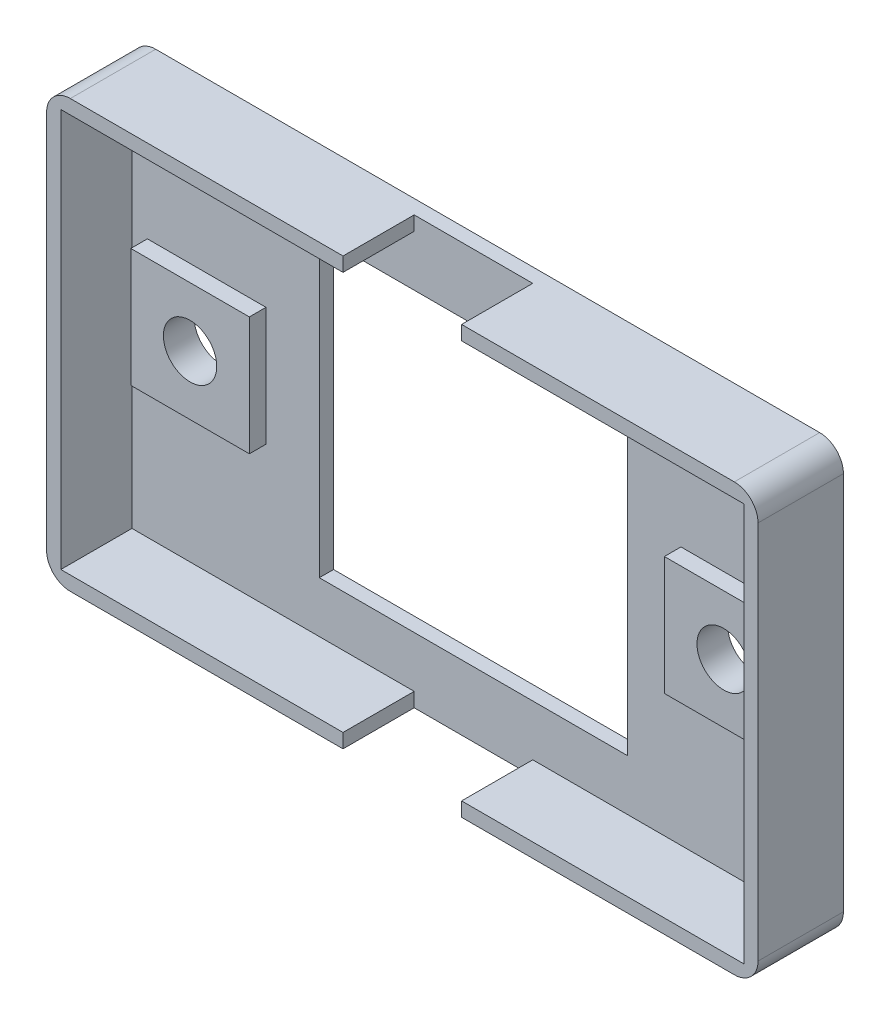
ISO-10303-21;
HEADER;
FILE_DESCRIPTION(('STEP AP214'),'2;1');
FILE_NAME('part.step','',(''),(''),'','','');
FILE_SCHEMA(('AUTOMOTIVE_DESIGN { 1 0 10303 214 1 1 1 1 }'));
ENDSEC;
DATA;
#1=APPLICATION_CONTEXT('core data for automotive mechanical design processes');
#2=APPLICATION_PROTOCOL_DEFINITION('international standard','automotive_design',2000,#1);
#3=PRODUCT_CONTEXT('',#1,'mechanical');
#4=PRODUCT('Part','Part','',(#3));
#5=PRODUCT_RELATED_PRODUCT_CATEGORY('part','',(#4));
#6=PRODUCT_DEFINITION_FORMATION('','',#4);
#7=PRODUCT_DEFINITION_CONTEXT('part definition',#1,'design');
#8=PRODUCT_DEFINITION('design','',#6,#7);
#9=PRODUCT_DEFINITION_SHAPE('','',#8);
#10=(LENGTH_UNIT() NAMED_UNIT(*) SI_UNIT(.MILLI.,.METRE.));
#11=(NAMED_UNIT(*) PLANE_ANGLE_UNIT() SI_UNIT($,.RADIAN.));
#12=(NAMED_UNIT(*) SI_UNIT($,.STERADIAN.) SOLID_ANGLE_UNIT());
#13=UNCERTAINTY_MEASURE_WITH_UNIT(LENGTH_MEASURE(1.E-05),#10,'distance_accuracy_value','');
#14=(GEOMETRIC_REPRESENTATION_CONTEXT(3) GLOBAL_UNCERTAINTY_ASSIGNED_CONTEXT((#13)) GLOBAL_UNIT_ASSIGNED_CONTEXT((#10,
#11,#12)) REPRESENTATION_CONTEXT('',''));
#15=CARTESIAN_POINT('',(0.,0.,0.));
#16=DIRECTION('',(0.,0.,1.));
#17=DIRECTION('',(1.,0.,0.));
#18=AXIS2_PLACEMENT_3D('',#15,#16,#17);
#19=CARTESIAN_POINT('',(0.,0.,1.2));
#20=DIRECTION('',(0.,0.,1.));
#21=DIRECTION('',(1.,0.,0.));
#22=AXIS2_PLACEMENT_3D('',#19,#20,#21);
#23=PLANE('',#22);
#24=DIRECTION('',(0.,1.,0.));
#25=VECTOR('',#24,1.);
#26=CARTESIAN_POINT('',(4.99999999999999,0.,1.2));
#27=LINE('',#26,#25);
#28=CARTESIAN_POINT('',(5.,-18.,1.2));
#29=VERTEX_POINT('',#28);
#30=CARTESIAN_POINT('',(5.,-16.8,1.2));
#31=VERTEX_POINT('',#30);
#32=EDGE_CURVE('E250',#29,#31,#27,.T.);
#33=ORIENTED_EDGE('',*,*,#32,.T.);
#34=DIRECTION('',(1.,0.,0.));
#35=VECTOR('',#34,1.);
#36=CARTESIAN_POINT('',(0.,-16.8,1.2));
#37=LINE('',#36,#35);
#38=CARTESIAN_POINT('',(28.8,-16.8,1.2));
#39=VERTEX_POINT('',#38);
#40=EDGE_CURVE('E266',#31,#39,#37,.T.);
#41=ORIENTED_EDGE('',*,*,#40,.T.);
#42=DIRECTION('',(0.,-1.,0.));
#43=VECTOR('',#42,1.);
#44=CARTESIAN_POINT('',(28.8,0.,1.2));
#45=LINE('',#44,#43);
#46=CARTESIAN_POINT('',(28.8,16.8,1.2));
#47=VERTEX_POINT('',#46);
#48=EDGE_CURVE('E268',#47,#39,#45,.T.);
#49=ORIENTED_EDGE('',*,*,#48,.F.);
#50=DIRECTION('',(1.,0.,0.));
#51=VECTOR('',#50,1.);
#52=CARTESIAN_POINT('',(0.,16.8,1.2));
#53=LINE('',#52,#51);
#54=CARTESIAN_POINT('',(5.,16.8,1.2));
#55=VERTEX_POINT('',#54);
#56=EDGE_CURVE('E289',#55,#47,#53,.T.);
#57=ORIENTED_EDGE('',*,*,#56,.F.);
#58=DIRECTION('',(0.,-1.,0.));
#59=VECTOR('',#58,1.);
#60=CARTESIAN_POINT('',(4.99999999999999,0.,1.2));
#61=LINE('',#60,#59);
#62=CARTESIAN_POINT('',(5.,18.,1.2));
#63=VERTEX_POINT('',#62);
#64=EDGE_CURVE('E286',#63,#55,#61,.T.);
#65=ORIENTED_EDGE('',*,*,#64,.F.);
#66=DIRECTION('',(-1.,0.,0.));
#67=VECTOR('',#66,1.);
#68=CARTESIAN_POINT('',(-30.,18.,1.2));
#69=LINE('',#68,#67);
#70=CARTESIAN_POINT('',(-5.,18.,1.2));
#71=VERTEX_POINT('',#70);
#72=EDGE_CURVE('E450',#63,#71,#69,.T.);
#73=ORIENTED_EDGE('',*,*,#72,.T.);
#74=DIRECTION('',(0.,-1.,0.));
#75=VECTOR('',#74,1.);
#76=CARTESIAN_POINT('',(-5.,0.,1.2));
#77=LINE('',#76,#75);
#78=CARTESIAN_POINT('',(-5.,16.8,1.2));
#79=VERTEX_POINT('',#78);
#80=EDGE_CURVE('E309',#71,#79,#77,.T.);
#81=ORIENTED_EDGE('',*,*,#80,.T.);
#82=DIRECTION('',(1.,0.,0.));
#83=VECTOR('',#82,1.);
#84=CARTESIAN_POINT('',(0.,16.8,1.2));
#85=LINE('',#84,#83);
#86=CARTESIAN_POINT('',(-28.8,16.8,1.2));
#87=VERTEX_POINT('',#86);
#88=EDGE_CURVE('E335',#87,#79,#85,.T.);
#89=ORIENTED_EDGE('',*,*,#88,.F.);
#90=DIRECTION('',(0.,-1.,0.));
#91=VECTOR('',#90,1.);
#92=CARTESIAN_POINT('',(-28.8,0.,1.2));
#93=LINE('',#92,#91);
#94=CARTESIAN_POINT('',(-28.8,-16.8,1.2));
#95=VERTEX_POINT('',#94);
#96=EDGE_CURVE('E333',#87,#95,#93,.T.);
#97=ORIENTED_EDGE('',*,*,#96,.T.);
#98=DIRECTION('',(1.,0.,0.));
#99=VECTOR('',#98,1.);
#100=CARTESIAN_POINT('',(0.,-16.8,1.2));
#101=LINE('',#100,#99);
#102=CARTESIAN_POINT('',(-5.,-16.8,1.2));
#103=VERTEX_POINT('',#102);
#104=EDGE_CURVE('E331',#95,#103,#101,.T.);
#105=ORIENTED_EDGE('',*,*,#104,.T.);
#106=DIRECTION('',(0.,1.,0.));
#107=VECTOR('',#106,1.);
#108=CARTESIAN_POINT('',(-5.,0.,1.2));
#109=LINE('',#108,#107);
#110=CARTESIAN_POINT('',(-5.,-18.,1.2));
#111=VERTEX_POINT('',#110);
#112=EDGE_CURVE('E252',#111,#103,#109,.T.);
#113=ORIENTED_EDGE('',*,*,#112,.F.);
#114=DIRECTION('',(1.,0.,0.));
#115=VECTOR('',#114,1.);
#116=CARTESIAN_POINT('',(-30.,-18.,1.2));
#117=LINE('',#116,#115);
#118=EDGE_CURVE('E452',#111,#29,#117,.T.);
#119=ORIENTED_EDGE('',*,*,#118,.T.);
#120=EDGE_LOOP('',(#33,#41,#49,#57,#65,#73,#81,#89,#97,#105,#113,#119));
#121=FACE_BOUND('',#120,.T.);
#122=DIRECTION('',(0.,-1.,0.));
#123=VECTOR('',#122,1.);
#124=CARTESIAN_POINT('',(27.5,0.,1.2));
#125=LINE('',#124,#123);
#126=CARTESIAN_POINT('',(27.5,5.,1.2));
#127=VERTEX_POINT('',#126);
#128=CARTESIAN_POINT('',(27.5,-5.,1.2));
#129=VERTEX_POINT('',#128);
#130=EDGE_CURVE('E356',#127,#129,#125,.T.);
#131=ORIENTED_EDGE('',*,*,#130,.T.);
#132=DIRECTION('',(1.,0.,0.));
#133=VECTOR('',#132,1.);
#134=CARTESIAN_POINT('',(0.,-5.,1.2));
#135=LINE('',#134,#133);
#136=CARTESIAN_POINT('',(17.5,-5.,1.2));
#137=VERTEX_POINT('',#136);
#138=EDGE_CURVE('E361',#137,#129,#135,.T.);
#139=ORIENTED_EDGE('',*,*,#138,.F.);
#140=DIRECTION('',(0.,-1.,0.));
#141=VECTOR('',#140,1.);
#142=CARTESIAN_POINT('',(17.5,0.,1.2));
#143=LINE('',#142,#141);
#144=CARTESIAN_POINT('',(17.5,5.,1.2));
#145=VERTEX_POINT('',#144);
#146=EDGE_CURVE('E374',#145,#137,#143,.T.);
#147=ORIENTED_EDGE('',*,*,#146,.F.);
#148=DIRECTION('',(1.,0.,0.));
#149=VECTOR('',#148,1.);
#150=CARTESIAN_POINT('',(0.,5.,1.2));
#151=LINE('',#150,#149);
#152=EDGE_CURVE('E371',#145,#127,#151,.T.);
#153=ORIENTED_EDGE('',*,*,#152,.T.);
#154=EDGE_LOOP('',(#131,#139,#147,#153));
#155=FACE_BOUND('',#154,.T.);
#156=DIRECTION('',(0.,-1.,0.));
#157=VECTOR('',#156,1.);
#158=CARTESIAN_POINT('',(-17.5,0.,1.2));
#159=LINE('',#158,#157);
#160=CARTESIAN_POINT('',(-17.5,5.,1.2));
#161=VERTEX_POINT('',#160);
#162=CARTESIAN_POINT('',(-17.5,-5.,1.2));
#163=VERTEX_POINT('',#162);
#164=EDGE_CURVE('E386',#161,#163,#159,.T.);
#165=ORIENTED_EDGE('',*,*,#164,.T.);
#166=DIRECTION('',(-1.,0.,0.));
#167=VECTOR('',#166,1.);
#168=CARTESIAN_POINT('',(0.,-5.,1.2));
#169=LINE('',#168,#167);
#170=CARTESIAN_POINT('',(-27.5,-5.,1.2));
#171=VERTEX_POINT('',#170);
#172=EDGE_CURVE('E391',#163,#171,#169,.T.);
#173=ORIENTED_EDGE('',*,*,#172,.T.);
#174=DIRECTION('',(0.,-1.,0.));
#175=VECTOR('',#174,1.);
#176=CARTESIAN_POINT('',(-27.5,0.,1.2));
#177=LINE('',#176,#175);
#178=CARTESIAN_POINT('',(-27.5,5.,1.2));
#179=VERTEX_POINT('',#178);
#180=EDGE_CURVE('E403',#179,#171,#177,.T.);
#181=ORIENTED_EDGE('',*,*,#180,.F.);
#182=DIRECTION('',(-1.,0.,0.));
#183=VECTOR('',#182,1.);
#184=CARTESIAN_POINT('',(0.,5.,1.2));
#185=LINE('',#184,#183);
#186=EDGE_CURVE('E400',#161,#179,#185,.T.);
#187=ORIENTED_EDGE('',*,*,#186,.F.);
#188=EDGE_LOOP('',(#165,#173,#181,#187));
#189=FACE_BOUND('',#188,.T.);
#190=DIRECTION('',(-1.,0.,0.));
#191=VECTOR('',#190,1.);
#192=CARTESIAN_POINT('',(-13.,12.5,1.2));
#193=LINE('',#192,#191);
#194=CARTESIAN_POINT('',(13.,12.5,1.2));
#195=VERTEX_POINT('',#194);
#196=CARTESIAN_POINT('',(-13.,12.5,1.2));
#197=VERTEX_POINT('',#196);
#198=EDGE_CURVE('E421',#195,#197,#193,.T.);
#199=ORIENTED_EDGE('',*,*,#198,.F.);
#200=DIRECTION('',(0.,1.,0.));
#201=VECTOR('',#200,1.);
#202=CARTESIAN_POINT('',(13.,12.5,1.2));
#203=LINE('',#202,#201);
#204=CARTESIAN_POINT('',(13.,-12.5,1.2));
#205=VERTEX_POINT('',#204);
#206=EDGE_CURVE('E419',#205,#195,#203,.T.);
#207=ORIENTED_EDGE('',*,*,#206,.F.);
#208=DIRECTION('',(1.,0.,0.));
#209=VECTOR('',#208,1.);
#210=CARTESIAN_POINT('',(-13.,-12.5,1.2));
#211=LINE('',#210,#209);
#212=CARTESIAN_POINT('',(-13.,-12.5,1.2));
#213=VERTEX_POINT('',#212);
#214=EDGE_CURVE('E427',#213,#205,#211,.T.);
#215=ORIENTED_EDGE('',*,*,#214,.F.);
#216=DIRECTION('',(0.,-1.,0.));
#217=VECTOR('',#216,1.);
#218=CARTESIAN_POINT('',(-13.,12.5,1.2));
#219=LINE('',#218,#217);
#220=EDGE_CURVE('E424',#197,#213,#219,.T.);
#221=ORIENTED_EDGE('',*,*,#220,.F.);
#222=EDGE_LOOP('',(#199,#207,#215,#221));
#223=FACE_BOUND('',#222,.T.);
#224=ADVANCED_FACE('F33',(#121,#155,#189,#223),#23,.T.);
#225=CARTESIAN_POINT('',(0.,0.,0.));
#226=DIRECTION('',(0.,0.,1.));
#227=DIRECTION('',(1.,0.,0.));
#228=AXIS2_PLACEMENT_3D('',#225,#226,#227);
#229=PLANE('',#228);
#230=CARTESIAN_POINT('',(-22.5,0.,0.));
#231=DIRECTION('',(0.,0.,1.));
#232=DIRECTION('',(1.,0.,0.));
#233=AXIS2_PLACEMENT_3D('',#230,#231,#232);
#234=CIRCLE('',#233,2.25);
#235=CARTESIAN_POINT('',(-20.25,0.,0.));
#236=VERTEX_POINT('',#235);
#237=EDGE_CURVE('E972',#236,#236,#234,.T.);
#238=ORIENTED_EDGE('',*,*,#237,.T.);
#239=EDGE_LOOP('',(#238));
#240=FACE_BOUND('',#239,.T.);
#241=CARTESIAN_POINT('',(22.5,0.,0.));
#242=DIRECTION('',(0.,0.,1.));
#243=DIRECTION('',(1.,0.,0.));
#244=AXIS2_PLACEMENT_3D('',#241,#242,#243);
#245=CIRCLE('',#244,2.25);
#246=CARTESIAN_POINT('',(24.75,0.,0.));
#247=VERTEX_POINT('',#246);
#248=EDGE_CURVE('E271',#247,#247,#245,.T.);
#249=ORIENTED_EDGE('',*,*,#248,.T.);
#250=EDGE_LOOP('',(#249));
#251=FACE_BOUND('',#250,.T.);
#252=DIRECTION('',(0.,-1.,0.));
#253=VECTOR('',#252,1.);
#254=CARTESIAN_POINT('',(-30.,18.,0.));
#255=LINE('',#254,#253);
#256=CARTESIAN_POINT('',(-30.,16.,0.));
#257=VERTEX_POINT('',#256);
#258=CARTESIAN_POINT('',(-30.,-16.,0.));
#259=VERTEX_POINT('',#258);
#260=EDGE_CURVE('E460',#257,#259,#255,.T.);
#261=ORIENTED_EDGE('',*,*,#260,.F.);
#262=CARTESIAN_POINT('',(-28.,16.,0.));
#263=DIRECTION('',(0.,0.,1.));
#264=DIRECTION('',(1.,0.,0.));
#265=AXIS2_PLACEMENT_3D('',#262,#263,#264);
#266=CIRCLE('',#265,2.);
#267=CARTESIAN_POINT('',(-28.,18.,0.));
#268=VERTEX_POINT('',#267);
#269=EDGE_CURVE('E474',#257,#268,#266,.F.);
#270=ORIENTED_EDGE('',*,*,#269,.T.);
#271=DIRECTION('',(-1.,0.,0.));
#272=VECTOR('',#271,1.);
#273=CARTESIAN_POINT('',(-30.,18.,0.));
#274=LINE('',#273,#272);
#275=CARTESIAN_POINT('',(28.,18.,0.));
#276=VERTEX_POINT('',#275);
#277=EDGE_CURVE('E457',#276,#268,#274,.T.);
#278=ORIENTED_EDGE('',*,*,#277,.F.);
#279=CARTESIAN_POINT('',(28.,16.,0.));
#280=DIRECTION('',(0.,0.,1.));
#281=DIRECTION('',(1.,0.,0.));
#282=AXIS2_PLACEMENT_3D('',#279,#280,#281);
#283=CIRCLE('',#282,2.);
#284=CARTESIAN_POINT('',(30.,16.,0.));
#285=VERTEX_POINT('',#284);
#286=EDGE_CURVE('E470',#276,#285,#283,.F.);
#287=ORIENTED_EDGE('',*,*,#286,.T.);
#288=DIRECTION('',(0.,1.,0.));
#289=VECTOR('',#288,1.);
#290=CARTESIAN_POINT('',(30.,18.,0.));
#291=LINE('',#290,#289);
#292=CARTESIAN_POINT('',(30.,-16.,0.));
#293=VERTEX_POINT('',#292);
#294=EDGE_CURVE('E449',#293,#285,#291,.T.);
#295=ORIENTED_EDGE('',*,*,#294,.F.);
#296=CARTESIAN_POINT('',(28.,-16.,0.));
#297=DIRECTION('',(0.,0.,1.));
#298=DIRECTION('',(1.,0.,0.));
#299=AXIS2_PLACEMENT_3D('',#296,#297,#298);
#300=CIRCLE('',#299,2.);
#301=CARTESIAN_POINT('',(28.,-18.,0.));
#302=VERTEX_POINT('',#301);
#303=EDGE_CURVE('E468',#293,#302,#300,.F.);
#304=ORIENTED_EDGE('',*,*,#303,.T.);
#305=DIRECTION('',(1.,0.,0.));
#306=VECTOR('',#305,1.);
#307=CARTESIAN_POINT('',(-30.,-18.,0.));
#308=LINE('',#307,#306);
#309=CARTESIAN_POINT('',(-28.,-18.,0.));
#310=VERTEX_POINT('',#309);
#311=EDGE_CURVE('E453',#310,#302,#308,.T.);
#312=ORIENTED_EDGE('',*,*,#311,.F.);
#313=CARTESIAN_POINT('',(-28.,-16.,0.));
#314=DIRECTION('',(0.,0.,1.));
#315=DIRECTION('',(1.,0.,0.));
#316=AXIS2_PLACEMENT_3D('',#313,#314,#315);
#317=CIRCLE('',#316,2.);
#318=EDGE_CURVE('E472',#310,#259,#317,.F.);
#319=ORIENTED_EDGE('',*,*,#318,.T.);
#320=EDGE_LOOP('',(#261,#270,#278,#287,#295,#304,#312,#319));
#321=FACE_BOUND('',#320,.T.);
#322=DIRECTION('',(0.,1.,0.));
#323=VECTOR('',#322,1.);
#324=CARTESIAN_POINT('',(13.,12.5,0.));
#325=LINE('',#324,#323);
#326=CARTESIAN_POINT('',(13.,-12.5,0.));
#327=VERTEX_POINT('',#326);
#328=CARTESIAN_POINT('',(13.,12.5,0.));
#329=VERTEX_POINT('',#328);
#330=EDGE_CURVE('E418',#327,#329,#325,.T.);
#331=ORIENTED_EDGE('',*,*,#330,.T.);
#332=DIRECTION('',(-1.,0.,0.));
#333=VECTOR('',#332,1.);
#334=CARTESIAN_POINT('',(-13.,12.5,0.));
#335=LINE('',#334,#333);
#336=CARTESIAN_POINT('',(-13.,12.5,0.));
#337=VERTEX_POINT('',#336);
#338=EDGE_CURVE('E432',#329,#337,#335,.T.);
#339=ORIENTED_EDGE('',*,*,#338,.T.);
#340=DIRECTION('',(0.,-1.,0.));
#341=VECTOR('',#340,1.);
#342=CARTESIAN_POINT('',(-13.,12.5,0.));
#343=LINE('',#342,#341);
#344=CARTESIAN_POINT('',(-13.,-12.5,0.));
#345=VERTEX_POINT('',#344);
#346=EDGE_CURVE('E435',#337,#345,#343,.T.);
#347=ORIENTED_EDGE('',*,*,#346,.T.);
#348=DIRECTION('',(1.,0.,0.));
#349=VECTOR('',#348,1.);
#350=CARTESIAN_POINT('',(-13.,-12.5,0.));
#351=LINE('',#350,#349);
#352=EDGE_CURVE('E422',#345,#327,#351,.T.);
#353=ORIENTED_EDGE('',*,*,#352,.T.);
#354=EDGE_LOOP('',(#331,#339,#347,#353));
#355=FACE_BOUND('',#354,.T.);
#356=ADVANCED_FACE('F498',(#240,#251,#321,#355),#229,.F.);
#357=CARTESIAN_POINT('',(30.,18.,1.2));
#358=DIRECTION('',(-1.,0.,0.));
#359=DIRECTION('',(0.,0.,1.));
#360=AXIS2_PLACEMENT_3D('',#357,#358,#359);
#361=PLANE('',#360);
#362=ORIENTED_EDGE('',*,*,#294,.T.);
#363=DIRECTION('',(0.,0.,-1.));
#364=VECTOR('',#363,1.);
#365=CARTESIAN_POINT('',(30.,16.,1.2));
#366=LINE('',#365,#364);
#367=CARTESIAN_POINT('',(30.,16.,7.2));
#368=VERTEX_POINT('',#367);
#369=EDGE_CURVE('E48',#285,#368,#366,.F.);
#370=ORIENTED_EDGE('',*,*,#369,.T.);
#371=DIRECTION('',(0.,1.,0.));
#372=VECTOR('',#371,1.);
#373=CARTESIAN_POINT('',(30.,0.,7.2));
#374=LINE('',#373,#372);
#375=CARTESIAN_POINT('',(30.,-16.,7.2));
#376=VERTEX_POINT('',#375);
#377=EDGE_CURVE('E261',#376,#368,#374,.T.);
#378=ORIENTED_EDGE('',*,*,#377,.F.);
#379=DIRECTION('',(0.,0.,-1.));
#380=VECTOR('',#379,1.);
#381=CARTESIAN_POINT('',(30.,-16.,1.2));
#382=LINE('',#381,#380);
#383=EDGE_CURVE('E489',#376,#293,#382,.T.);
#384=ORIENTED_EDGE('',*,*,#383,.T.);
#385=EDGE_LOOP('',(#362,#370,#378,#384));
#386=FACE_BOUND('',#385,.T.);
#387=ADVANCED_FACE('F494',(#386),#361,.F.);
#388=CARTESIAN_POINT('',(-30.,18.,1.2));
#389=DIRECTION('',(0.,-1.,0.));
#390=DIRECTION('',(0.,0.,-1.));
#391=AXIS2_PLACEMENT_3D('',#388,#389,#390);
#392=PLANE('',#391);
#393=ORIENTED_EDGE('',*,*,#277,.T.);
#394=DIRECTION('',(0.,0.,-1.));
#395=VECTOR('',#394,1.);
#396=CARTESIAN_POINT('',(-28.,18.,1.2));
#397=LINE('',#396,#395);
#398=CARTESIAN_POINT('',(-28.,18.,7.2));
#399=VERTEX_POINT('',#398);
#400=EDGE_CURVE('E479',#268,#399,#397,.F.);
#401=ORIENTED_EDGE('',*,*,#400,.T.);
#402=DIRECTION('',(-1.,0.,0.));
#403=VECTOR('',#402,1.);
#404=CARTESIAN_POINT('',(0.,18.,7.2));
#405=LINE('',#404,#403);
#406=CARTESIAN_POINT('',(-5.,18.,7.2));
#407=VERTEX_POINT('',#406);
#408=EDGE_CURVE('E322',#407,#399,#405,.T.);
#409=ORIENTED_EDGE('',*,*,#408,.F.);
#410=DIRECTION('',(0.,0.,-1.));
#411=VECTOR('',#410,1.);
#412=CARTESIAN_POINT('',(-5.,18.,7.2));
#413=LINE('',#412,#411);
#414=EDGE_CURVE('E328',#407,#71,#413,.T.);
#415=ORIENTED_EDGE('',*,*,#414,.T.);
#416=ORIENTED_EDGE('',*,*,#72,.F.);
#417=DIRECTION('',(0.,0.,-1.));
#418=VECTOR('',#417,1.);
#419=CARTESIAN_POINT('',(5.,18.,7.2));
#420=LINE('',#419,#418);
#421=CARTESIAN_POINT('',(5.,18.,7.2));
#422=VERTEX_POINT('',#421);
#423=EDGE_CURVE('E253',#422,#63,#420,.T.);
#424=ORIENTED_EDGE('',*,*,#423,.F.);
#425=DIRECTION('',(-1.,0.,0.));
#426=VECTOR('',#425,1.);
#427=CARTESIAN_POINT('',(0.,18.,7.2));
#428=LINE('',#427,#426);
#429=CARTESIAN_POINT('',(28.,18.,7.2));
#430=VERTEX_POINT('',#429);
#431=EDGE_CURVE('E275',#430,#422,#428,.T.);
#432=ORIENTED_EDGE('',*,*,#431,.F.);
#433=DIRECTION('',(0.,0.,-1.));
#434=VECTOR('',#433,1.);
#435=CARTESIAN_POINT('',(28.,18.,1.2));
#436=LINE('',#435,#434);
#437=EDGE_CURVE('E476',#430,#276,#436,.T.);
#438=ORIENTED_EDGE('',*,*,#437,.T.);
#439=EDGE_LOOP('',(#393,#401,#409,#415,#416,#424,#432,#438));
#440=FACE_BOUND('',#439,.T.);
#441=ADVANCED_FACE('F508',(#440),#392,.F.);
#442=CARTESIAN_POINT('',(-30.,18.,1.2));
#443=DIRECTION('',(1.,0.,0.));
#444=DIRECTION('',(0.,0.,-1.));
#445=AXIS2_PLACEMENT_3D('',#442,#443,#444);
#446=PLANE('',#445);
#447=DIRECTION('',(0.,-1.,0.));
#448=VECTOR('',#447,1.);
#449=CARTESIAN_POINT('',(-30.,0.,7.2));
#450=LINE('',#449,#448);
#451=CARTESIAN_POINT('',(-30.,16.,7.2));
#452=VERTEX_POINT('',#451);
#453=CARTESIAN_POINT('',(-30.,-16.,7.2));
#454=VERTEX_POINT('',#453);
#455=EDGE_CURVE('E325',#452,#454,#450,.T.);
#456=ORIENTED_EDGE('',*,*,#455,.F.);
#457=DIRECTION('',(0.,0.,-1.));
#458=VECTOR('',#457,1.);
#459=CARTESIAN_POINT('',(-30.,16.,1.2));
#460=LINE('',#459,#458);
#461=EDGE_CURVE('E465',#452,#257,#460,.T.);
#462=ORIENTED_EDGE('',*,*,#461,.T.);
#463=ORIENTED_EDGE('',*,*,#260,.T.);
#464=DIRECTION('',(0.,0.,-1.));
#465=VECTOR('',#464,1.);
#466=CARTESIAN_POINT('',(-30.,-16.,1.2));
#467=LINE('',#466,#465);
#468=EDGE_CURVE('E455',#259,#454,#467,.F.);
#469=ORIENTED_EDGE('',*,*,#468,.T.);
#470=EDGE_LOOP('',(#456,#462,#463,#469));
#471=FACE_BOUND('',#470,.T.);
#472=ADVANCED_FACE('F546',(#471),#446,.F.);
#473=CARTESIAN_POINT('',(-30.,-18.,1.2));
#474=DIRECTION('',(0.,1.,0.));
#475=DIRECTION('',(0.,0.,1.));
#476=AXIS2_PLACEMENT_3D('',#473,#474,#475);
#477=PLANE('',#476);
#478=DIRECTION('',(1.,0.,0.));
#479=VECTOR('',#478,1.);
#480=CARTESIAN_POINT('',(0.,-18.,7.2));
#481=LINE('',#480,#479);
#482=CARTESIAN_POINT('',(-28.,-18.,7.2));
#483=VERTEX_POINT('',#482);
#484=CARTESIAN_POINT('',(-5.,-18.,7.2));
#485=VERTEX_POINT('',#484);
#486=EDGE_CURVE('E306',#483,#485,#481,.T.);
#487=ORIENTED_EDGE('',*,*,#486,.F.);
#488=DIRECTION('',(0.,0.,-1.));
#489=VECTOR('',#488,1.);
#490=CARTESIAN_POINT('',(-28.,-18.,1.2));
#491=LINE('',#490,#489);
#492=EDGE_CURVE('E486',#483,#310,#491,.T.);
#493=ORIENTED_EDGE('',*,*,#492,.T.);
#494=ORIENTED_EDGE('',*,*,#311,.T.);
#495=DIRECTION('',(0.,0.,-1.));
#496=VECTOR('',#495,1.);
#497=CARTESIAN_POINT('',(28.,-18.,1.2));
#498=LINE('',#497,#496);
#499=CARTESIAN_POINT('',(28.,-18.,7.2));
#500=VERTEX_POINT('',#499);
#501=EDGE_CURVE('E260',#302,#500,#498,.F.);
#502=ORIENTED_EDGE('',*,*,#501,.T.);
#503=DIRECTION('',(1.,0.,0.));
#504=VECTOR('',#503,1.);
#505=CARTESIAN_POINT('',(0.,-18.,7.2));
#506=LINE('',#505,#504);
#507=CARTESIAN_POINT('',(5.,-18.,7.2));
#508=VERTEX_POINT('',#507);
#509=EDGE_CURVE('E255',#508,#500,#506,.T.);
#510=ORIENTED_EDGE('',*,*,#509,.F.);
#511=DIRECTION('',(0.,0.,-1.));
#512=VECTOR('',#511,1.);
#513=CARTESIAN_POINT('',(5.,-18.,7.2));
#514=LINE('',#513,#512);
#515=EDGE_CURVE('E243',#508,#29,#514,.T.);
#516=ORIENTED_EDGE('',*,*,#515,.T.);
#517=ORIENTED_EDGE('',*,*,#118,.F.);
#518=DIRECTION('',(0.,0.,-1.));
#519=VECTOR('',#518,1.);
#520=CARTESIAN_POINT('',(-5.,-18.,7.2));
#521=LINE('',#520,#519);
#522=EDGE_CURVE('E353',#485,#111,#521,.T.);
#523=ORIENTED_EDGE('',*,*,#522,.F.);
#524=EDGE_LOOP('',(#487,#493,#494,#502,#510,#516,#517,#523));
#525=FACE_BOUND('',#524,.T.);
#526=ADVANCED_FACE('F257',(#525),#477,.F.);
#527=CARTESIAN_POINT('',(13.,12.5,1.2));
#528=DIRECTION('',(-1.,0.,0.));
#529=DIRECTION('',(0.,-1.,0.));
#530=AXIS2_PLACEMENT_3D('',#527,#528,#529);
#531=PLANE('',#530);
#532=ORIENTED_EDGE('',*,*,#330,.F.);
#533=DIRECTION('',(0.,0.,-1.));
#534=VECTOR('',#533,1.);
#535=CARTESIAN_POINT('',(13.,-12.5,1.2));
#536=LINE('',#535,#534);
#537=EDGE_CURVE('E429',#205,#327,#536,.T.);
#538=ORIENTED_EDGE('',*,*,#537,.F.);
#539=ORIENTED_EDGE('',*,*,#206,.T.);
#540=DIRECTION('',(0.,0.,-1.));
#541=VECTOR('',#540,1.);
#542=CARTESIAN_POINT('',(13.,12.5,1.2));
#543=LINE('',#542,#541);
#544=EDGE_CURVE('E446',#195,#329,#543,.T.);
#545=ORIENTED_EDGE('',*,*,#544,.T.);
#546=EDGE_LOOP('',(#532,#538,#539,#545));
#547=FACE_BOUND('',#546,.T.);
#548=ADVANCED_FACE('F583',(#547),#531,.T.);
#549=CARTESIAN_POINT('',(-13.,12.5,1.2));
#550=DIRECTION('',(0.,-1.,0.));
#551=DIRECTION('',(0.,0.,-1.));
#552=AXIS2_PLACEMENT_3D('',#549,#550,#551);
#553=PLANE('',#552);
#554=ORIENTED_EDGE('',*,*,#338,.F.);
#555=ORIENTED_EDGE('',*,*,#544,.F.);
#556=ORIENTED_EDGE('',*,*,#198,.T.);
#557=DIRECTION('',(0.,0.,-1.));
#558=VECTOR('',#557,1.);
#559=CARTESIAN_POINT('',(-13.,12.5,1.2));
#560=LINE('',#559,#558);
#561=EDGE_CURVE('E444',#197,#337,#560,.T.);
#562=ORIENTED_EDGE('',*,*,#561,.T.);
#563=EDGE_LOOP('',(#554,#555,#556,#562));
#564=FACE_BOUND('',#563,.T.);
#565=ADVANCED_FACE('F888',(#564),#553,.T.);
#566=CARTESIAN_POINT('',(-13.,12.5,1.2));
#567=DIRECTION('',(1.,0.,0.));
#568=DIRECTION('',(0.,1.,0.));
#569=AXIS2_PLACEMENT_3D('',#566,#567,#568);
#570=PLANE('',#569);
#571=ORIENTED_EDGE('',*,*,#346,.F.);
#572=ORIENTED_EDGE('',*,*,#561,.F.);
#573=ORIENTED_EDGE('',*,*,#220,.T.);
#574=DIRECTION('',(0.,0.,-1.));
#575=VECTOR('',#574,1.);
#576=CARTESIAN_POINT('',(-13.,-12.5,1.2));
#577=LINE('',#576,#575);
#578=EDGE_CURVE('E442',#213,#345,#577,.T.);
#579=ORIENTED_EDGE('',*,*,#578,.T.);
#580=EDGE_LOOP('',(#571,#572,#573,#579));
#581=FACE_BOUND('',#580,.T.);
#582=ADVANCED_FACE('F878',(#581),#570,.T.);
#583=CARTESIAN_POINT('',(-13.,-12.5,1.2));
#584=DIRECTION('',(0.,1.,0.));
#585=DIRECTION('',(0.,0.,1.));
#586=AXIS2_PLACEMENT_3D('',#583,#584,#585);
#587=PLANE('',#586);
#588=ORIENTED_EDGE('',*,*,#352,.F.);
#589=ORIENTED_EDGE('',*,*,#578,.F.);
#590=ORIENTED_EDGE('',*,*,#214,.T.);
#591=ORIENTED_EDGE('',*,*,#537,.T.);
#592=EDGE_LOOP('',(#588,#589,#590,#591));
#593=FACE_BOUND('',#592,.T.);
#594=ADVANCED_FACE('F868',(#593),#587,.T.);
#595=CARTESIAN_POINT('',(-17.5,0.,2.6));
#596=DIRECTION('',(1.,0.,0.));
#597=DIRECTION('',(0.,0.,-1.));
#598=AXIS2_PLACEMENT_3D('',#595,#596,#597);
#599=PLANE('',#598);
#600=ORIENTED_EDGE('',*,*,#164,.F.);
#601=DIRECTION('',(0.,0.,-1.));
#602=VECTOR('',#601,1.);
#603=CARTESIAN_POINT('',(-17.5,5.,2.6));
#604=LINE('',#603,#602);
#605=CARTESIAN_POINT('',(-17.5,5.,2.6));
#606=VERTEX_POINT('',#605);
#607=EDGE_CURVE('E415',#606,#161,#604,.T.);
#608=ORIENTED_EDGE('',*,*,#607,.F.);
#609=DIRECTION('',(0.,-1.,0.));
#610=VECTOR('',#609,1.);
#611=CARTESIAN_POINT('',(-17.5,0.,2.6));
#612=LINE('',#611,#610);
#613=CARTESIAN_POINT('',(-17.5,-5.,2.6));
#614=VERTEX_POINT('',#613);
#615=EDGE_CURVE('E387',#606,#614,#612,.T.);
#616=ORIENTED_EDGE('',*,*,#615,.T.);
#617=DIRECTION('',(0.,0.,-1.));
#618=VECTOR('',#617,1.);
#619=CARTESIAN_POINT('',(-17.5,-5.,2.6));
#620=LINE('',#619,#618);
#621=EDGE_CURVE('E398',#614,#163,#620,.T.);
#622=ORIENTED_EDGE('',*,*,#621,.T.);
#623=EDGE_LOOP('',(#600,#608,#616,#622));
#624=FACE_BOUND('',#623,.T.);
#625=ADVANCED_FACE('F858',(#624),#599,.T.);
#626=CARTESIAN_POINT('',(0.,5.,2.6));
#627=DIRECTION('',(0.,-1.,0.));
#628=DIRECTION('',(0.,0.,-1.));
#629=AXIS2_PLACEMENT_3D('',#626,#627,#628);
#630=PLANE('',#629);
#631=ORIENTED_EDGE('',*,*,#186,.T.);
#632=DIRECTION('',(0.,0.,-1.));
#633=VECTOR('',#632,1.);
#634=CARTESIAN_POINT('',(-27.5,5.,2.6));
#635=LINE('',#634,#633);
#636=CARTESIAN_POINT('',(-27.5,5.,2.6));
#637=VERTEX_POINT('',#636);
#638=EDGE_CURVE('E412',#637,#179,#635,.T.);
#639=ORIENTED_EDGE('',*,*,#638,.F.);
#640=DIRECTION('',(-1.,0.,0.));
#641=VECTOR('',#640,1.);
#642=CARTESIAN_POINT('',(0.,5.,2.6));
#643=LINE('',#642,#641);
#644=EDGE_CURVE('E390',#606,#637,#643,.T.);
#645=ORIENTED_EDGE('',*,*,#644,.F.);
#646=ORIENTED_EDGE('',*,*,#607,.T.);
#647=EDGE_LOOP('',(#631,#639,#645,#646));
#648=FACE_BOUND('',#647,.T.);
#649=ADVANCED_FACE('F848',(#648),#630,.F.);
#650=CARTESIAN_POINT('',(-27.5,0.,2.6));
#651=DIRECTION('',(1.,0.,0.));
#652=DIRECTION('',(0.,0.,-1.));
#653=AXIS2_PLACEMENT_3D('',#650,#651,#652);
#654=PLANE('',#653);
#655=ORIENTED_EDGE('',*,*,#180,.T.);
#656=DIRECTION('',(0.,0.,-1.));
#657=VECTOR('',#656,1.);
#658=CARTESIAN_POINT('',(-27.5,-5.,2.6));
#659=LINE('',#658,#657);
#660=CARTESIAN_POINT('',(-27.5,-5.,2.6));
#661=VERTEX_POINT('',#660);
#662=EDGE_CURVE('E409',#661,#171,#659,.T.);
#663=ORIENTED_EDGE('',*,*,#662,.F.);
#664=DIRECTION('',(0.,-1.,0.));
#665=VECTOR('',#664,1.);
#666=CARTESIAN_POINT('',(-27.5,0.,2.6));
#667=LINE('',#666,#665);
#668=EDGE_CURVE('E393',#637,#661,#667,.T.);
#669=ORIENTED_EDGE('',*,*,#668,.F.);
#670=ORIENTED_EDGE('',*,*,#638,.T.);
#671=EDGE_LOOP('',(#655,#663,#669,#670));
#672=FACE_BOUND('',#671,.T.);
#673=ADVANCED_FACE('F838',(#672),#654,.F.);
#674=CARTESIAN_POINT('',(0.,-5.,2.6));
#675=DIRECTION('',(0.,-1.,0.));
#676=DIRECTION('',(0.,0.,-1.));
#677=AXIS2_PLACEMENT_3D('',#674,#675,#676);
#678=PLANE('',#677);
#679=ORIENTED_EDGE('',*,*,#172,.F.);
#680=ORIENTED_EDGE('',*,*,#621,.F.);
#681=DIRECTION('',(-1.,0.,0.));
#682=VECTOR('',#681,1.);
#683=CARTESIAN_POINT('',(0.,-5.,2.6));
#684=LINE('',#683,#682);
#685=EDGE_CURVE('E395',#614,#661,#684,.T.);
#686=ORIENTED_EDGE('',*,*,#685,.T.);
#687=ORIENTED_EDGE('',*,*,#662,.T.);
#688=EDGE_LOOP('',(#679,#680,#686,#687));
#689=FACE_BOUND('',#688,.T.);
#690=ADVANCED_FACE('F724',(#689),#678,.T.);
#691=CARTESIAN_POINT('',(0.,0.,2.6));
#692=DIRECTION('',(0.,0.,1.));
#693=DIRECTION('',(1.,0.,0.));
#694=AXIS2_PLACEMENT_3D('',#691,#692,#693);
#695=PLANE('',#694);
#696=CARTESIAN_POINT('',(-22.5,0.,2.6));
#697=DIRECTION('',(0.,0.,1.));
#698=DIRECTION('',(1.,0.,0.));
#699=AXIS2_PLACEMENT_3D('',#696,#697,#698);
#700=CIRCLE('',#699,2.24999999999999);
#701=CARTESIAN_POINT('',(-20.25,0.,2.6));
#702=VERTEX_POINT('',#701);
#703=EDGE_CURVE('E970',#702,#702,#700,.T.);
#704=ORIENTED_EDGE('',*,*,#703,.F.);
#705=EDGE_LOOP('',(#704));
#706=FACE_BOUND('',#705,.T.);
#707=ORIENTED_EDGE('',*,*,#615,.F.);
#708=ORIENTED_EDGE('',*,*,#644,.T.);
#709=ORIENTED_EDGE('',*,*,#668,.T.);
#710=ORIENTED_EDGE('',*,*,#685,.F.);
#711=EDGE_LOOP('',(#707,#708,#709,#710));
#712=FACE_BOUND('',#711,.T.);
#713=ADVANCED_FACE('F718',(#706,#712),#695,.T.);
#714=CARTESIAN_POINT('',(27.5,0.,2.6));
#715=DIRECTION('',(1.,0.,0.));
#716=DIRECTION('',(0.,0.,-1.));
#717=AXIS2_PLACEMENT_3D('',#714,#715,#716);
#718=PLANE('',#717);
#719=ORIENTED_EDGE('',*,*,#130,.F.);
#720=DIRECTION('',(0.,0.,-1.));
#721=VECTOR('',#720,1.);
#722=CARTESIAN_POINT('',(27.5,5.,2.6));
#723=LINE('',#722,#721);
#724=CARTESIAN_POINT('',(27.5,5.,2.6));
#725=VERTEX_POINT('',#724);
#726=EDGE_CURVE('E384',#725,#127,#723,.T.);
#727=ORIENTED_EDGE('',*,*,#726,.F.);
#728=DIRECTION('',(0.,-1.,0.));
#729=VECTOR('',#728,1.);
#730=CARTESIAN_POINT('',(27.5,0.,2.6));
#731=LINE('',#730,#729);
#732=CARTESIAN_POINT('',(27.5,-5.,2.6));
#733=VERTEX_POINT('',#732);
#734=EDGE_CURVE('E357',#725,#733,#731,.T.);
#735=ORIENTED_EDGE('',*,*,#734,.T.);
#736=DIRECTION('',(0.,0.,-1.));
#737=VECTOR('',#736,1.);
#738=CARTESIAN_POINT('',(27.5,-5.,2.6));
#739=LINE('',#738,#737);
#740=EDGE_CURVE('E368',#733,#129,#739,.T.);
#741=ORIENTED_EDGE('',*,*,#740,.T.);
#742=EDGE_LOOP('',(#719,#727,#735,#741));
#743=FACE_BOUND('',#742,.T.);
#744=ADVANCED_FACE('F723',(#743),#718,.T.);
#745=CARTESIAN_POINT('',(0.,5.,2.6));
#746=DIRECTION('',(0.,1.,0.));
#747=DIRECTION('',(0.,0.,1.));
#748=AXIS2_PLACEMENT_3D('',#745,#746,#747);
#749=PLANE('',#748);
#750=ORIENTED_EDGE('',*,*,#152,.F.);
#751=DIRECTION('',(0.,0.,-1.));
#752=VECTOR('',#751,1.);
#753=CARTESIAN_POINT('',(17.5,5.,2.6));
#754=LINE('',#753,#752);
#755=CARTESIAN_POINT('',(17.5,5.,2.6));
#756=VERTEX_POINT('',#755);
#757=EDGE_CURVE('E382',#756,#145,#754,.T.);
#758=ORIENTED_EDGE('',*,*,#757,.F.);
#759=DIRECTION('',(1.,0.,0.));
#760=VECTOR('',#759,1.);
#761=CARTESIAN_POINT('',(0.,5.,2.6));
#762=LINE('',#761,#760);
#763=EDGE_CURVE('E360',#756,#725,#762,.T.);
#764=ORIENTED_EDGE('',*,*,#763,.T.);
#765=ORIENTED_EDGE('',*,*,#726,.T.);
#766=EDGE_LOOP('',(#750,#758,#764,#765));
#767=FACE_BOUND('',#766,.T.);
#768=ADVANCED_FACE('F814',(#767),#749,.T.);
#769=CARTESIAN_POINT('',(17.5,0.,2.6));
#770=DIRECTION('',(1.,0.,0.));
#771=DIRECTION('',(0.,0.,-1.));
#772=AXIS2_PLACEMENT_3D('',#769,#770,#771);
#773=PLANE('',#772);
#774=ORIENTED_EDGE('',*,*,#146,.T.);
#775=DIRECTION('',(0.,0.,-1.));
#776=VECTOR('',#775,1.);
#777=CARTESIAN_POINT('',(17.5,-5.,2.6));
#778=LINE('',#777,#776);
#779=CARTESIAN_POINT('',(17.5,-5.,2.6));
#780=VERTEX_POINT('',#779);
#781=EDGE_CURVE('E380',#780,#137,#778,.T.);
#782=ORIENTED_EDGE('',*,*,#781,.F.);
#783=DIRECTION('',(0.,-1.,0.));
#784=VECTOR('',#783,1.);
#785=CARTESIAN_POINT('',(17.5,0.,2.6));
#786=LINE('',#785,#784);
#787=EDGE_CURVE('E364',#756,#780,#786,.T.);
#788=ORIENTED_EDGE('',*,*,#787,.F.);
#789=ORIENTED_EDGE('',*,*,#757,.T.);
#790=EDGE_LOOP('',(#774,#782,#788,#789));
#791=FACE_BOUND('',#790,.T.);
#792=ADVANCED_FACE('F804',(#791),#773,.F.);
#793=CARTESIAN_POINT('',(0.,-5.,2.6));
#794=DIRECTION('',(0.,1.,0.));
#795=DIRECTION('',(0.,0.,1.));
#796=AXIS2_PLACEMENT_3D('',#793,#794,#795);
#797=PLANE('',#796);
#798=ORIENTED_EDGE('',*,*,#138,.T.);
#799=ORIENTED_EDGE('',*,*,#740,.F.);
#800=DIRECTION('',(1.,0.,0.));
#801=VECTOR('',#800,1.);
#802=CARTESIAN_POINT('',(0.,-5.,2.6));
#803=LINE('',#802,#801);
#804=EDGE_CURVE('E366',#780,#733,#803,.T.);
#805=ORIENTED_EDGE('',*,*,#804,.F.);
#806=ORIENTED_EDGE('',*,*,#781,.T.);
#807=EDGE_LOOP('',(#798,#799,#805,#806));
#808=FACE_BOUND('',#807,.T.);
#809=ADVANCED_FACE('F709',(#808),#797,.F.);
#810=CARTESIAN_POINT('',(0.,0.,2.6));
#811=DIRECTION('',(0.,0.,1.));
#812=DIRECTION('',(1.,0.,0.));
#813=AXIS2_PLACEMENT_3D('',#810,#811,#812);
#814=PLANE('',#813);
#815=CARTESIAN_POINT('',(22.5,0.,2.6));
#816=DIRECTION('',(0.,0.,1.));
#817=DIRECTION('',(1.,0.,0.));
#818=AXIS2_PLACEMENT_3D('',#815,#816,#817);
#819=CIRCLE('',#818,2.24999999999999);
#820=CARTESIAN_POINT('',(24.75,0.,2.6));
#821=VERTEX_POINT('',#820);
#822=EDGE_CURVE('E975',#821,#821,#819,.T.);
#823=ORIENTED_EDGE('',*,*,#822,.F.);
#824=EDGE_LOOP('',(#823));
#825=FACE_BOUND('',#824,.T.);
#826=ORIENTED_EDGE('',*,*,#734,.F.);
#827=ORIENTED_EDGE('',*,*,#763,.F.);
#828=ORIENTED_EDGE('',*,*,#787,.T.);
#829=ORIENTED_EDGE('',*,*,#804,.T.);
#830=EDGE_LOOP('',(#826,#827,#828,#829));
#831=FACE_BOUND('',#830,.T.);
#832=ADVANCED_FACE('F573',(#825,#831),#814,.T.);
#833=CARTESIAN_POINT('',(-5.,0.,7.2));
#834=DIRECTION('',(-1.,0.,0.));
#835=DIRECTION('',(0.,0.,1.));
#836=AXIS2_PLACEMENT_3D('',#833,#834,#835);
#837=PLANE('',#836);
#838=ORIENTED_EDGE('',*,*,#112,.T.);
#839=DIRECTION('',(0.,0.,-1.));
#840=VECTOR('',#839,1.);
#841=CARTESIAN_POINT('',(-5.,-16.8,7.2));
#842=LINE('',#841,#840);
#843=CARTESIAN_POINT('',(-5.,-16.8,7.2));
#844=VERTEX_POINT('',#843);
#845=EDGE_CURVE('E350',#844,#103,#842,.T.);
#846=ORIENTED_EDGE('',*,*,#845,.F.);
#847=DIRECTION('',(0.,1.,0.));
#848=VECTOR('',#847,1.);
#849=CARTESIAN_POINT('',(-5.,0.,7.2));
#850=LINE('',#849,#848);
#851=EDGE_CURVE('E308',#485,#844,#850,.T.);
#852=ORIENTED_EDGE('',*,*,#851,.F.);
#853=ORIENTED_EDGE('',*,*,#522,.T.);
#854=EDGE_LOOP('',(#838,#846,#852,#853));
#855=FACE_BOUND('',#854,.T.);
#856=ADVANCED_FACE('F534',(#855),#837,.F.);
#857=CARTESIAN_POINT('',(0.,-16.8,7.2));
#858=DIRECTION('',(0.,1.,0.));
#859=DIRECTION('',(0.,0.,1.));
#860=AXIS2_PLACEMENT_3D('',#857,#858,#859);
#861=PLANE('',#860);
#862=ORIENTED_EDGE('',*,*,#104,.F.);
#863=DIRECTION('',(0.,0.,-1.));
#864=VECTOR('',#863,1.);
#865=CARTESIAN_POINT('',(-28.8,-16.8,7.2));
#866=LINE('',#865,#864);
#867=CARTESIAN_POINT('',(-28.8,-16.8,7.2));
#868=VERTEX_POINT('',#867);
#869=EDGE_CURVE('E347',#868,#95,#866,.T.);
#870=ORIENTED_EDGE('',*,*,#869,.F.);
#871=DIRECTION('',(1.,0.,0.));
#872=VECTOR('',#871,1.);
#873=CARTESIAN_POINT('',(0.,-16.8,7.2));
#874=LINE('',#873,#872);
#875=EDGE_CURVE('E311',#868,#844,#874,.T.);
#876=ORIENTED_EDGE('',*,*,#875,.T.);
#877=ORIENTED_EDGE('',*,*,#845,.T.);
#878=EDGE_LOOP('',(#862,#870,#876,#877));
#879=FACE_BOUND('',#878,.T.);
#880=ADVANCED_FACE('F565',(#879),#861,.T.);
#881=CARTESIAN_POINT('',(-28.8,0.,7.2));
#882=DIRECTION('',(1.,0.,0.));
#883=DIRECTION('',(0.,0.,-1.));
#884=AXIS2_PLACEMENT_3D('',#881,#882,#883);
#885=PLANE('',#884);
#886=ORIENTED_EDGE('',*,*,#96,.F.);
#887=DIRECTION('',(0.,0.,-1.));
#888=VECTOR('',#887,1.);
#889=CARTESIAN_POINT('',(-28.8,16.8,7.2));
#890=LINE('',#889,#888);
#891=CARTESIAN_POINT('',(-28.8,16.8,7.2));
#892=VERTEX_POINT('',#891);
#893=EDGE_CURVE('E344',#892,#87,#890,.T.);
#894=ORIENTED_EDGE('',*,*,#893,.F.);
#895=DIRECTION('',(0.,-1.,0.));
#896=VECTOR('',#895,1.);
#897=CARTESIAN_POINT('',(-28.8,0.,7.2));
#898=LINE('',#897,#896);
#899=EDGE_CURVE('E314',#892,#868,#898,.T.);
#900=ORIENTED_EDGE('',*,*,#899,.T.);
#901=ORIENTED_EDGE('',*,*,#869,.T.);
#902=EDGE_LOOP('',(#886,#894,#900,#901));
#903=FACE_BOUND('',#902,.T.);
#904=ADVANCED_FACE('F562',(#903),#885,.T.);
#905=CARTESIAN_POINT('',(0.,16.8,7.2));
#906=DIRECTION('',(0.,1.,0.));
#907=DIRECTION('',(0.,0.,1.));
#908=AXIS2_PLACEMENT_3D('',#905,#906,#907);
#909=PLANE('',#908);
#910=ORIENTED_EDGE('',*,*,#88,.T.);
#911=DIRECTION('',(0.,0.,-1.));
#912=VECTOR('',#911,1.);
#913=CARTESIAN_POINT('',(-5.,16.8,7.2));
#914=LINE('',#913,#912);
#915=CARTESIAN_POINT('',(-5.,16.8,7.2));
#916=VERTEX_POINT('',#915);
#917=EDGE_CURVE('E341',#916,#79,#914,.T.);
#918=ORIENTED_EDGE('',*,*,#917,.F.);
#919=DIRECTION('',(1.,0.,0.));
#920=VECTOR('',#919,1.);
#921=CARTESIAN_POINT('',(0.,16.8,7.2));
#922=LINE('',#921,#920);
#923=EDGE_CURVE('E317',#892,#916,#922,.T.);
#924=ORIENTED_EDGE('',*,*,#923,.F.);
#925=ORIENTED_EDGE('',*,*,#893,.T.);
#926=EDGE_LOOP('',(#910,#918,#924,#925));
#927=FACE_BOUND('',#926,.T.);
#928=ADVANCED_FACE('F560',(#927),#909,.F.);
#929=CARTESIAN_POINT('',(-5.,0.,7.2));
#930=DIRECTION('',(1.,0.,0.));
#931=DIRECTION('',(0.,0.,-1.));
#932=AXIS2_PLACEMENT_3D('',#929,#930,#931);
#933=PLANE('',#932);
#934=ORIENTED_EDGE('',*,*,#80,.F.);
#935=ORIENTED_EDGE('',*,*,#414,.F.);
#936=DIRECTION('',(0.,-1.,0.));
#937=VECTOR('',#936,1.);
#938=CARTESIAN_POINT('',(-5.,0.,7.2));
#939=LINE('',#938,#937);
#940=EDGE_CURVE('E319',#407,#916,#939,.T.);
#941=ORIENTED_EDGE('',*,*,#940,.T.);
#942=ORIENTED_EDGE('',*,*,#917,.T.);
#943=EDGE_LOOP('',(#934,#935,#941,#942));
#944=FACE_BOUND('',#943,.T.);
#945=ADVANCED_FACE('F557',(#944),#933,.T.);
#946=CARTESIAN_POINT('',(0.,0.,7.2));
#947=DIRECTION('',(0.,0.,1.));
#948=DIRECTION('',(1.,0.,0.));
#949=AXIS2_PLACEMENT_3D('',#946,#947,#948);
#950=PLANE('',#949);
#951=ORIENTED_EDGE('',*,*,#408,.T.);
#952=CARTESIAN_POINT('',(-28.,16.,7.2));
#953=DIRECTION('',(0.,0.,1.));
#954=DIRECTION('',(1.,0.,0.));
#955=AXIS2_PLACEMENT_3D('',#952,#953,#954);
#956=CIRCLE('',#955,2.);
#957=EDGE_CURVE('E483',#399,#452,#956,.T.);
#958=ORIENTED_EDGE('',*,*,#957,.T.);
#959=ORIENTED_EDGE('',*,*,#455,.T.);
#960=CARTESIAN_POINT('',(-28.,-16.,7.2));
#961=DIRECTION('',(0.,0.,1.));
#962=DIRECTION('',(1.,0.,0.));
#963=AXIS2_PLACEMENT_3D('',#960,#961,#962);
#964=CIRCLE('',#963,2.);
#965=EDGE_CURVE('E481',#454,#483,#964,.T.);
#966=ORIENTED_EDGE('',*,*,#965,.T.);
#967=ORIENTED_EDGE('',*,*,#486,.T.);
#968=ORIENTED_EDGE('',*,*,#851,.T.);
#969=ORIENTED_EDGE('',*,*,#875,.F.);
#970=ORIENTED_EDGE('',*,*,#899,.F.);
#971=ORIENTED_EDGE('',*,*,#923,.T.);
#972=ORIENTED_EDGE('',*,*,#940,.F.);
#973=EDGE_LOOP('',(#951,#958,#959,#966,#967,#968,#969,#970,#971,#972));
#974=FACE_BOUND('',#973,.T.);
#975=ADVANCED_FACE('F538',(#974),#950,.T.);
#976=CARTESIAN_POINT('',(4.99999999999999,0.,7.2));
#977=DIRECTION('',(-1.,0.,0.));
#978=DIRECTION('',(0.,-1.,0.));
#979=AXIS2_PLACEMENT_3D('',#976,#977,#978);
#980=PLANE('',#979);
#981=ORIENTED_EDGE('',*,*,#32,.F.);
#982=ORIENTED_EDGE('',*,*,#515,.F.);
#983=DIRECTION('',(0.,1.,0.));
#984=VECTOR('',#983,1.);
#985=CARTESIAN_POINT('',(4.99999999999999,0.,7.2));
#986=LINE('',#985,#984);
#987=CARTESIAN_POINT('',(5.,-16.8,7.2));
#988=VERTEX_POINT('',#987);
#989=EDGE_CURVE('E248',#508,#988,#986,.T.);
#990=ORIENTED_EDGE('',*,*,#989,.T.);
#991=DIRECTION('',(0.,0.,-1.));
#992=VECTOR('',#991,1.);
#993=CARTESIAN_POINT('',(5.,-16.8,7.2));
#994=LINE('',#993,#992);
#995=EDGE_CURVE('E284',#988,#31,#994,.T.);
#996=ORIENTED_EDGE('',*,*,#995,.T.);
#997=EDGE_LOOP('',(#981,#982,#990,#996));
#998=FACE_BOUND('',#997,.T.);
#999=ADVANCED_FACE('F245',(#998),#980,.T.);
#1000=CARTESIAN_POINT('',(4.99999999999999,0.,7.2));
#1001=DIRECTION('',(1.,0.,0.));
#1002=DIRECTION('',(0.,1.,0.));
#1003=AXIS2_PLACEMENT_3D('',#1000,#1001,#1002);
#1004=PLANE('',#1003);
#1005=ORIENTED_EDGE('',*,*,#64,.T.);
#1006=DIRECTION('',(0.,0.,-1.));
#1007=VECTOR('',#1006,1.);
#1008=CARTESIAN_POINT('',(5.,16.8,7.2));
#1009=LINE('',#1008,#1007);
#1010=CARTESIAN_POINT('',(5.,16.8,7.2));
#1011=VERTEX_POINT('',#1010);
#1012=EDGE_CURVE('E301',#1011,#55,#1009,.T.);
#1013=ORIENTED_EDGE('',*,*,#1012,.F.);
#1014=DIRECTION('',(0.,-1.,0.));
#1015=VECTOR('',#1014,1.);
#1016=CARTESIAN_POINT('',(4.99999999999999,0.,7.2));
#1017=LINE('',#1016,#1015);
#1018=EDGE_CURVE('E277',#422,#1011,#1017,.T.);
#1019=ORIENTED_EDGE('',*,*,#1018,.F.);
#1020=ORIENTED_EDGE('',*,*,#423,.T.);
#1021=EDGE_LOOP('',(#1005,#1013,#1019,#1020));
#1022=FACE_BOUND('',#1021,.T.);
#1023=ADVANCED_FACE('F517',(#1022),#1004,.F.);
#1024=CARTESIAN_POINT('',(0.,16.8,7.2));
#1025=DIRECTION('',(0.,1.,0.));
#1026=DIRECTION('',(0.,0.,1.));
#1027=AXIS2_PLACEMENT_3D('',#1024,#1025,#1026);
#1028=PLANE('',#1027);
#1029=ORIENTED_EDGE('',*,*,#56,.T.);
#1030=DIRECTION('',(0.,0.,-1.));
#1031=VECTOR('',#1030,1.);
#1032=CARTESIAN_POINT('',(28.8,16.8,7.2));
#1033=LINE('',#1032,#1031);
#1034=CARTESIAN_POINT('',(28.8,16.8,7.2));
#1035=VERTEX_POINT('',#1034);
#1036=EDGE_CURVE('E298',#1035,#47,#1033,.T.);
#1037=ORIENTED_EDGE('',*,*,#1036,.F.);
#1038=DIRECTION('',(1.,0.,0.));
#1039=VECTOR('',#1038,1.);
#1040=CARTESIAN_POINT('',(0.,16.8,7.2));
#1041=LINE('',#1040,#1039);
#1042=EDGE_CURVE('E279',#1011,#1035,#1041,.T.);
#1043=ORIENTED_EDGE('',*,*,#1042,.F.);
#1044=ORIENTED_EDGE('',*,*,#1012,.T.);
#1045=EDGE_LOOP('',(#1029,#1037,#1043,#1044));
#1046=FACE_BOUND('',#1045,.T.);
#1047=ADVANCED_FACE('F519',(#1046),#1028,.F.);
#1048=CARTESIAN_POINT('',(28.8,0.,7.2));
#1049=DIRECTION('',(1.,0.,0.));
#1050=DIRECTION('',(0.,0.,-1.));
#1051=AXIS2_PLACEMENT_3D('',#1048,#1049,#1050);
#1052=PLANE('',#1051);
#1053=ORIENTED_EDGE('',*,*,#48,.T.);
#1054=DIRECTION('',(0.,0.,-1.));
#1055=VECTOR('',#1054,1.);
#1056=CARTESIAN_POINT('',(28.8,-16.8,7.2));
#1057=LINE('',#1056,#1055);
#1058=CARTESIAN_POINT('',(28.8,-16.8,7.2));
#1059=VERTEX_POINT('',#1058);
#1060=EDGE_CURVE('E295',#1059,#39,#1057,.T.);
#1061=ORIENTED_EDGE('',*,*,#1060,.F.);
#1062=DIRECTION('',(0.,-1.,0.));
#1063=VECTOR('',#1062,1.);
#1064=CARTESIAN_POINT('',(28.8,0.,7.2));
#1065=LINE('',#1064,#1063);
#1066=EDGE_CURVE('E281',#1035,#1059,#1065,.T.);
#1067=ORIENTED_EDGE('',*,*,#1066,.F.);
#1068=ORIENTED_EDGE('',*,*,#1036,.T.);
#1069=EDGE_LOOP('',(#1053,#1061,#1067,#1068));
#1070=FACE_BOUND('',#1069,.T.);
#1071=ADVANCED_FACE('F523',(#1070),#1052,.F.);
#1072=CARTESIAN_POINT('',(0.,-16.8,7.2));
#1073=DIRECTION('',(0.,1.,0.));
#1074=DIRECTION('',(0.,0.,1.));
#1075=AXIS2_PLACEMENT_3D('',#1072,#1073,#1074);
#1076=PLANE('',#1075);
#1077=ORIENTED_EDGE('',*,*,#40,.F.);
#1078=ORIENTED_EDGE('',*,*,#995,.F.);
#1079=DIRECTION('',(1.,0.,0.));
#1080=VECTOR('',#1079,1.);
#1081=CARTESIAN_POINT('',(0.,-16.8,7.2));
#1082=LINE('',#1081,#1080);
#1083=EDGE_CURVE('E265',#988,#1059,#1082,.T.);
#1084=ORIENTED_EDGE('',*,*,#1083,.T.);
#1085=ORIENTED_EDGE('',*,*,#1060,.T.);
#1086=EDGE_LOOP('',(#1077,#1078,#1084,#1085));
#1087=FACE_BOUND('',#1086,.T.);
#1088=ADVANCED_FACE('F526',(#1087),#1076,.T.);
#1089=CARTESIAN_POINT('',(0.,0.,7.2));
#1090=DIRECTION('',(0.,0.,1.));
#1091=DIRECTION('',(1.,0.,0.));
#1092=AXIS2_PLACEMENT_3D('',#1089,#1090,#1091);
#1093=PLANE('',#1092);
#1094=ORIENTED_EDGE('',*,*,#377,.T.);
#1095=CARTESIAN_POINT('',(28.,16.,7.2));
#1096=DIRECTION('',(0.,0.,1.));
#1097=DIRECTION('',(1.,0.,0.));
#1098=AXIS2_PLACEMENT_3D('',#1095,#1096,#1097);
#1099=CIRCLE('',#1098,2.);
#1100=EDGE_CURVE('E11',#368,#430,#1099,.T.);
#1101=ORIENTED_EDGE('',*,*,#1100,.T.);
#1102=ORIENTED_EDGE('',*,*,#431,.T.);
#1103=ORIENTED_EDGE('',*,*,#1018,.T.);
#1104=ORIENTED_EDGE('',*,*,#1042,.T.);
#1105=ORIENTED_EDGE('',*,*,#1066,.T.);
#1106=ORIENTED_EDGE('',*,*,#1083,.F.);
#1107=ORIENTED_EDGE('',*,*,#989,.F.);
#1108=ORIENTED_EDGE('',*,*,#509,.T.);
#1109=CARTESIAN_POINT('',(28.,-16.,7.2));
#1110=DIRECTION('',(0.,0.,1.));
#1111=DIRECTION('',(1.,0.,0.));
#1112=AXIS2_PLACEMENT_3D('',#1109,#1110,#1111);
#1113=CIRCLE('',#1112,2.);
#1114=EDGE_CURVE('E41',#500,#376,#1113,.T.);
#1115=ORIENTED_EDGE('',*,*,#1114,.T.);
#1116=EDGE_LOOP('',(#1094,#1101,#1102,#1103,#1104,#1105,#1106,#1107,#1108,#1115));
#1117=FACE_BOUND('',#1116,.T.);
#1118=ADVANCED_FACE('F263',(#1117),#1093,.T.);
#1119=CARTESIAN_POINT('',(22.5,0.,2.6));
#1120=DIRECTION('',(0.,0.,1.));
#1121=DIRECTION('',(1.,0.,0.));
#1122=AXIS2_PLACEMENT_3D('',#1119,#1120,#1121);
#1123=CYLINDRICAL_SURFACE('',#1122,2.24999999999999);
#1124=ORIENTED_EDGE('',*,*,#248,.F.);
#1125=EDGE_LOOP('',(#1124));
#1126=FACE_BOUND('',#1125,.T.);
#1127=ORIENTED_EDGE('',*,*,#822,.T.);
#1128=EDGE_LOOP('',(#1127));
#1129=FACE_BOUND('',#1128,.T.);
#1130=ADVANCED_FACE('F631',(#1126,#1129),#1123,.F.);
#1131=CARTESIAN_POINT('',(-22.5,0.,2.6));
#1132=DIRECTION('',(0.,0.,1.));
#1133=DIRECTION('',(1.,0.,0.));
#1134=AXIS2_PLACEMENT_3D('',#1131,#1132,#1133);
#1135=CYLINDRICAL_SURFACE('',#1134,2.24999999999999);
#1136=ORIENTED_EDGE('',*,*,#237,.F.);
#1137=EDGE_LOOP('',(#1136));
#1138=FACE_BOUND('',#1137,.T.);
#1139=ORIENTED_EDGE('',*,*,#703,.T.);
#1140=EDGE_LOOP('',(#1139));
#1141=FACE_BOUND('',#1140,.T.);
#1142=ADVANCED_FACE('F596',(#1138,#1141),#1135,.F.);
#1143=CARTESIAN_POINT('',(-28.,16.,1.2));
#1144=DIRECTION('',(0.,0.,-1.));
#1145=DIRECTION('',(-1.,0.,0.));
#1146=AXIS2_PLACEMENT_3D('',#1143,#1144,#1145);
#1147=CYLINDRICAL_SURFACE('',#1146,2.);
#1148=ORIENTED_EDGE('',*,*,#957,.F.);
#1149=ORIENTED_EDGE('',*,*,#400,.F.);
#1150=ORIENTED_EDGE('',*,*,#269,.F.);
#1151=ORIENTED_EDGE('',*,*,#461,.F.);
#1152=EDGE_LOOP('',(#1148,#1149,#1150,#1151));
#1153=FACE_BOUND('',#1152,.T.);
#1154=ADVANCED_FACE('F550',(#1153),#1147,.T.);
#1155=CARTESIAN_POINT('',(-28.,-16.,1.2));
#1156=DIRECTION('',(0.,0.,-1.));
#1157=DIRECTION('',(-1.,0.,0.));
#1158=AXIS2_PLACEMENT_3D('',#1155,#1156,#1157);
#1159=CYLINDRICAL_SURFACE('',#1158,2.);
#1160=ORIENTED_EDGE('',*,*,#965,.F.);
#1161=ORIENTED_EDGE('',*,*,#468,.F.);
#1162=ORIENTED_EDGE('',*,*,#318,.F.);
#1163=ORIENTED_EDGE('',*,*,#492,.F.);
#1164=EDGE_LOOP('',(#1160,#1161,#1162,#1163));
#1165=FACE_BOUND('',#1164,.T.);
#1166=ADVANCED_FACE('F544',(#1165),#1159,.T.);
#1167=CARTESIAN_POINT('',(28.,16.,1.2));
#1168=DIRECTION('',(0.,0.,-1.));
#1169=DIRECTION('',(-1.,0.,0.));
#1170=AXIS2_PLACEMENT_3D('',#1167,#1168,#1169);
#1171=CYLINDRICAL_SURFACE('',#1170,2.);
#1172=ORIENTED_EDGE('',*,*,#1100,.F.);
#1173=ORIENTED_EDGE('',*,*,#369,.F.);
#1174=ORIENTED_EDGE('',*,*,#286,.F.);
#1175=ORIENTED_EDGE('',*,*,#437,.F.);
#1176=EDGE_LOOP('',(#1172,#1173,#1174,#1175));
#1177=FACE_BOUND('',#1176,.T.);
#1178=ADVANCED_FACE('F505',(#1177),#1171,.T.);
#1179=CARTESIAN_POINT('',(28.,-16.,1.2));
#1180=DIRECTION('',(0.,0.,-1.));
#1181=DIRECTION('',(-1.,0.,0.));
#1182=AXIS2_PLACEMENT_3D('',#1179,#1180,#1181);
#1183=CYLINDRICAL_SURFACE('',#1182,2.);
#1184=ORIENTED_EDGE('',*,*,#1114,.F.);
#1185=ORIENTED_EDGE('',*,*,#501,.F.);
#1186=ORIENTED_EDGE('',*,*,#303,.F.);
#1187=ORIENTED_EDGE('',*,*,#383,.F.);
#1188=EDGE_LOOP('',(#1184,#1185,#1186,#1187));
#1189=FACE_BOUND('',#1188,.T.);
#1190=ADVANCED_FACE('F35',(#1189),#1183,.T.);
#1191=CLOSED_SHELL('',(#224,#356,#387,#441,#472,#526,#548,#565,#582,#594,#625,#649,#673,#690,
#713,#744,#768,#792,#809,#832,#856,#880,#904,#928,#945,#975,#999,#1023,#1047,#1071,#1088,#1118,
#1130,#1142,#1154,#1166,#1178,#1190));
#1192=MANIFOLD_SOLID_BREP('B2',#1191);
#1193=ADVANCED_BREP_SHAPE_REPRESENTATION('',(#18,#1192),#14);
#1194=SHAPE_DEFINITION_REPRESENTATION(#9,#1193);
ENDSEC;
END-ISO-10303-21;
